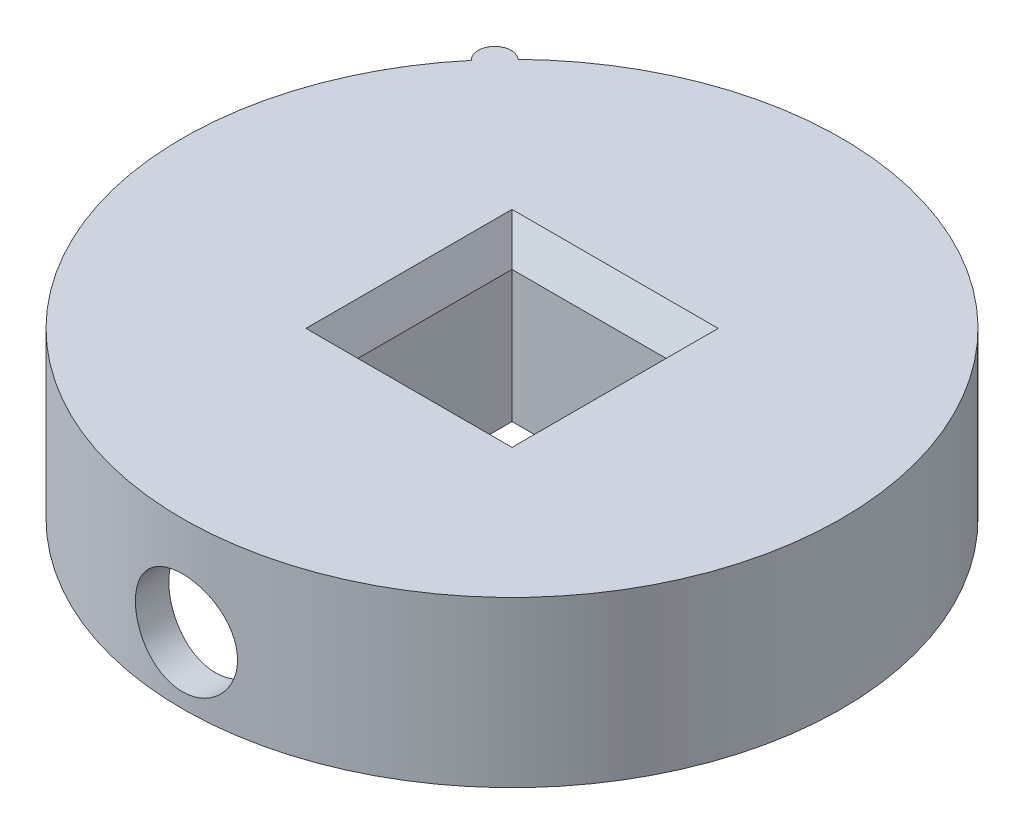
ISO-10303-21;
HEADER;
FILE_DESCRIPTION(('STEP AP214'),'2;1');
FILE_NAME('part.step','',(''),(''),'','','');
FILE_SCHEMA(('AUTOMOTIVE_DESIGN { 1 0 10303 214 1 1 1 1 }'));
ENDSEC;
DATA;
#1=APPLICATION_CONTEXT('core data for automotive mechanical design processes');
#2=APPLICATION_PROTOCOL_DEFINITION('international standard','automotive_design',2000,#1);
#3=PRODUCT_CONTEXT('',#1,'mechanical');
#4=PRODUCT('Part','Part','',(#3));
#5=PRODUCT_RELATED_PRODUCT_CATEGORY('part','',(#4));
#6=PRODUCT_DEFINITION_FORMATION('','',#4);
#7=PRODUCT_DEFINITION_CONTEXT('part definition',#1,'design');
#8=PRODUCT_DEFINITION('design','',#6,#7);
#9=PRODUCT_DEFINITION_SHAPE('','',#8);
#10=(LENGTH_UNIT() NAMED_UNIT(*) SI_UNIT(.MILLI.,.METRE.));
#11=(NAMED_UNIT(*) PLANE_ANGLE_UNIT() SI_UNIT($,.RADIAN.));
#12=(NAMED_UNIT(*) SI_UNIT($,.STERADIAN.) SOLID_ANGLE_UNIT());
#13=UNCERTAINTY_MEASURE_WITH_UNIT(LENGTH_MEASURE(1.E-05),#10,'distance_accuracy_value','');
#14=(GEOMETRIC_REPRESENTATION_CONTEXT(3) GLOBAL_UNCERTAINTY_ASSIGNED_CONTEXT((#13)) GLOBAL_UNIT_ASSIGNED_CONTEXT((#10,
#11,#12)) REPRESENTATION_CONTEXT('',''));
#15=CARTESIAN_POINT('',(0.,0.,0.));
#16=DIRECTION('',(0.,0.,1.));
#17=DIRECTION('',(1.,0.,0.));
#18=AXIS2_PLACEMENT_3D('',#15,#16,#17);
#19=CARTESIAN_POINT('',(0.,10.,0.));
#20=DIRECTION('',(0.,-1.,0.));
#21=DIRECTION('',(0.,0.,-1.));
#22=AXIS2_PLACEMENT_3D('',#19,#20,#21);
#23=CYLINDRICAL_SURFACE('',#22,20.);
#24=CARTESIAN_POINT('',(0.,10.,0.));
#25=DIRECTION('',(0.,1.,0.));
#26=DIRECTION('',(0.,0.,1.));
#27=AXIS2_PLACEMENT_3D('',#24,#25,#26);
#28=CIRCLE('',#27,20.);
#29=CARTESIAN_POINT('',(-15.3208888623795,10.,-12.8557521937308));
#30=VERTEX_POINT('',#29);
#31=CARTESIAN_POINT('',(-13.960317173332,10.,-14.3216460094491));
#32=VERTEX_POINT('',#31);
#33=EDGE_CURVE('E130',#30,#32,#28,.T.);
#34=ORIENTED_EDGE('',*,*,#33,.F.);
#35=DIRECTION('',(0.,1.,0.));
#36=VECTOR('',#35,1.);
#37=CARTESIAN_POINT('',(-15.3208888623796,-2.41380726338418,-12.8557521937307));
#38=LINE('',#37,#36);
#39=CARTESIAN_POINT('',(-15.3208888623796,0.,-12.8557521937307));
#40=VERTEX_POINT('',#39);
#41=EDGE_CURVE('E134',#40,#30,#38,.T.);
#42=ORIENTED_EDGE('',*,*,#41,.F.);
#43=CARTESIAN_POINT('',(0.,0.,0.));
#44=DIRECTION('',(0.,1.,0.));
#45=DIRECTION('',(0.,0.,1.));
#46=AXIS2_PLACEMENT_3D('',#43,#44,#45);
#47=CIRCLE('',#46,20.);
#48=CARTESIAN_POINT('',(-13.960317173332,0.,-14.3216460094491));
#49=VERTEX_POINT('',#48);
#50=EDGE_CURVE('E123',#40,#49,#47,.T.);
#51=ORIENTED_EDGE('',*,*,#50,.T.);
#52=DIRECTION('',(0.,1.,0.));
#53=VECTOR('',#52,1.);
#54=CARTESIAN_POINT('',(-13.9603171733319,-2.41380726338418,-14.3216460094492));
#55=LINE('',#54,#53);
#56=EDGE_CURVE('E140',#49,#32,#55,.T.);
#57=ORIENTED_EDGE('',*,*,#56,.T.);
#58=EDGE_LOOP('',(#34,#42,#51,#57));
#59=FACE_BOUND('',#58,.T.);
#60=CARTESIAN_POINT('',(0.,0.9,20.));
#61=CARTESIAN_POINT('',(0.173016557974578,0.900007080795432,19.9999971650391));
#62=CARTESIAN_POINT('',(0.34613178639695,0.914533455175428,19.9977314078076));
#63=CARTESIAN_POINT('',(0.687518635637837,0.972237701724927,19.9889109487694));
#64=CARTESIAN_POINT('',(0.855785454793477,1.01544302312093,19.9823521380743));
#65=CARTESIAN_POINT('',(1.18248593303596,1.1291791256332,19.9656822285072));
#66=CARTESIAN_POINT('',(1.34092709214203,1.19968875969523,19.9555738792985));
#67=CARTESIAN_POINT('',(1.64370610687182,1.36597920536802,19.9329202594809));
#68=CARTESIAN_POINT('',(1.78804581720928,1.46175668743951,19.9203753099998));
#69=CARTESIAN_POINT('',(2.05974845786461,1.67671260326108,19.8941255745019));
#70=CARTESIAN_POINT('',(2.18697707204052,1.79605986049788,19.8804128527335));
#71=CARTESIAN_POINT('',(2.4196867060257,2.05440416109371,19.85343479463));
#72=CARTESIAN_POINT('',(2.52516644076686,2.19340236474357,19.8401694847697));
#73=CARTESIAN_POINT('',(2.71191152805789,2.48801131649957,19.8155112551125));
#74=CARTESIAN_POINT('',(2.79304608511286,2.64370590555726,19.8041285915852));
#75=CARTESIAN_POINT('',(2.92796168702672,2.96671880338056,19.7846333252768));
#76=CARTESIAN_POINT('',(2.98174432506344,3.13403643448893,19.7765205320398));
#77=CARTESIAN_POINT('',(3.06001047470206,3.47412991875066,19.7645618858971));
#78=CARTESIAN_POINT('',(3.08472451807274,3.64685151766504,19.7606824776643));
#79=CARTESIAN_POINT('',(3.1048662780187,3.99403042740349,19.7575280822113));
#80=CARTESIAN_POINT('',(3.10029578872548,4.16848763124104,19.758252812916));
#81=CARTESIAN_POINT('',(3.06218643754866,4.5125521067266,19.7641941390446));
#82=CARTESIAN_POINT('',(3.02890496858939,4.68218867658666,19.7693708216034));
#83=CARTESIAN_POINT('',(2.93472161326262,5.01344040797057,19.783570384335));
#84=CARTESIAN_POINT('',(2.87381889722358,5.17505532838282,19.7925933800408));
#85=CARTESIAN_POINT('',(2.72585610559503,5.48645559505007,19.8135127113495));
#86=CARTESIAN_POINT('',(2.63868762651754,5.6361886031537,19.8254209140239));
#87=CARTESIAN_POINT('',(2.44074483457386,5.91899998169321,19.8507604280544));
#88=CARTESIAN_POINT('',(2.32996886913798,6.05207718515487,19.8641918460077));
#89=CARTESIAN_POINT('',(2.0865457846287,6.29929060689683,19.8912404778778));
#90=CARTESIAN_POINT('',(1.95367749855783,6.41320911235008,19.9048581429418));
#91=CARTESIAN_POINT('',(1.67059352836411,6.61716458384982,19.9306117241799));
#92=CARTESIAN_POINT('',(1.52037775867124,6.70720143208794,19.9427476330443));
#93=CARTESIAN_POINT('',(1.20666955981141,6.86085145308918,19.9641842572175));
#94=CARTESIAN_POINT('',(1.04316842223976,6.92444712418766,19.973483093561));
#95=CARTESIAN_POINT('',(0.707630368591965,7.02321658476251,19.9881823322231));
#96=CARTESIAN_POINT('',(0.535594070043371,7.05839242726859,19.9935830161389));
#97=CARTESIAN_POINT('',(0.18974745321463,7.09903258858386,19.999839979177));
#98=CARTESIAN_POINT('',(0.0159730895823901,7.10479609111716,20.0007420165939));
#99=CARTESIAN_POINT('',(-0.330059915144203,7.08724310983438,19.9980248327243));
#100=CARTESIAN_POINT('',(-0.5023186062509,7.06392758918426,19.9944057611877));
#101=CARTESIAN_POINT('',(-0.839519062554434,6.98912721291357,19.9830813062526));
#102=CARTESIAN_POINT('',(-1.00449408808775,6.93778880133858,19.9753971727289));
#103=CARTESIAN_POINT('',(-1.32349525981676,6.80855487063498,19.9568011840378));
#104=CARTESIAN_POINT('',(-1.4775208615223,6.73065803193059,19.9458891684944));
#105=CARTESIAN_POINT('',(-1.7715619191957,6.54982138344464,19.9219357385274));
#106=CARTESIAN_POINT('',(-1.91145985994471,6.44669262669295,19.9088785142824));
#107=CARTESIAN_POINT('',(-2.17206987835387,6.21858173575031,19.8821353568535));
#108=CARTESIAN_POINT('',(-2.29278076018428,6.09359824048571,19.8684493845514));
#109=CARTESIAN_POINT('',(-2.51268466926641,5.82399085535137,19.8418452953327));
#110=CARTESIAN_POINT('',(-2.61167667299673,5.67920210042096,19.8289350943909));
#111=CARTESIAN_POINT('',(-2.78393359428538,5.37487547615815,19.805486686096));
#112=CARTESIAN_POINT('',(-2.85719924335206,5.21533802635611,19.7949484113023));
#113=CARTESIAN_POINT('',(-2.97561529141455,4.88663129933381,19.7774949611492));
#114=CARTESIAN_POINT('',(-3.02086981632308,4.71750027657163,19.7705663828432));
#115=CARTESIAN_POINT('',(-3.08230938314147,4.37392249209178,19.7610817453396));
#116=CARTESIAN_POINT('',(-3.09849658118311,4.1994761256275,19.7585253618258));
#117=CARTESIAN_POINT('',(-3.10128813555182,3.85222422779024,19.7580872149381));
#118=CARTESIAN_POINT('',(-3.08820865954259,3.67942121854002,19.7601554912251));
#119=CARTESIAN_POINT('',(-3.03351744801726,3.33850471906413,19.7686247773595));
#120=CARTESIAN_POINT('',(-2.99190577093735,3.17039121923471,19.7750257783332));
#121=CARTESIAN_POINT('',(-2.88144589881863,2.84372354234137,19.791421373363));
#122=CARTESIAN_POINT('',(-2.81262129276619,2.68516122283937,19.801412854401));
#123=CARTESIAN_POINT('',(-2.64972096024408,2.3817828432796,19.8238671717296));
#124=CARTESIAN_POINT('',(-2.55564426248003,2.23696731226727,19.836330103077));
#125=CARTESIAN_POINT('',(-2.34376738116094,1.96358948224111,19.862483054043));
#126=CARTESIAN_POINT('',(-2.22573346513276,1.83520939110733,19.876184362017));
#127=CARTESIAN_POINT('',(-1.96978661876277,1.59996736742,19.903177261943));
#128=CARTESIAN_POINT('',(-1.8318690851942,1.49311043142968,19.9164687581527));
#129=CARTESIAN_POINT('',(-1.53910930505027,1.30338057555414,19.9412344524066));
#130=CARTESIAN_POINT('',(-1.38417199504349,1.22065289513756,19.9526974646132));
#131=CARTESIAN_POINT('',(-1.06249346622742,1.08252095182279,19.9724052696854));
#132=CARTESIAN_POINT('',(-0.895764538907991,1.02708870280286,19.9806533570105));
#133=CARTESIAN_POINT('',(-0.606929877005346,0.957540053066292,19.9911430658503));
#134=CARTESIAN_POINT('',(-0.486597179715198,0.935995962038425,19.9944471586378));
#135=CARTESIAN_POINT('',(-0.244192691603641,0.907223534809589,19.9988766112674));
#136=CARTESIAN_POINT('',(-0.122120924673141,0.899995002135659,20.000002001011));
#137=CARTESIAN_POINT('',(0.,0.9,20.));
#138=B_SPLINE_CURVE_WITH_KNOTS('',3,(#60,#61,#62,#63,#64,#65,#66,#67,#68,#69,#70,#71,#72,#73,
#74,#75,#76,#77,#78,#79,#80,#81,#82,#83,#84,#85,#86,#87,#88,#89,#90,#91,#92,#93,#94,#95,#96,#97,
#98,#99,#100,#101,#102,#103,#104,#105,#106,#107,#108,#109,#110,#111,#112,#113,#114,#115,#116,
#117,#118,#119,#120,#121,#122,#123,#124,#125,#126,#127,#128,#129,#130,#131,#132,#133,#134,#135,
#136,#137),.UNSPECIFIED.,.T.,.F.,(4,2,2,2,2,2,2,2,2,2,2,2,2,2,2,2,2,2,2,2,2,2,2,2,2,2,2,2,2,2,2,
2,2,2,2,2,2,2,4),(0.,0.518603389696483,1.03770386276341,1.55640309660684,2.07503401566504,
2.59752406878385,3.12004498524092,3.64532487300955,4.17057416109137,4.69162919625163,
5.21265230902045,5.72905244255467,6.24546808845431,6.76404496609117,7.28265815704321,
7.80681594553428,8.33097631965123,8.85548309023761,9.3799519674113,9.89907513525496,
10.4181811089692,10.9345999175123,11.4510443884596,11.9714813947096,12.4919508243877,
13.0170514007104,13.5421370450079,14.0652588749373,14.5883418995712,15.105801374666,
15.6232597899663,16.1402706366429,16.6573013724327,17.1796423654186,17.7021044795559,
18.2276494116379,18.7526543724209,19.1187071678768,19.4847549394298),.UNSPECIFIED.);
#139=CARTESIAN_POINT('',(0.,0.9,20.));
#140=VERTEX_POINT('',#139);
#141=EDGE_CURVE('E147',#140,#140,#138,.T.);
#142=ORIENTED_EDGE('',*,*,#141,.F.);
#143=EDGE_LOOP('',(#142));
#144=FACE_BOUND('',#143,.T.);
#145=ADVANCED_FACE('F34',(#59,#144),#23,.T.);
#146=CARTESIAN_POINT('',(0.,10.,0.));
#147=DIRECTION('',(0.,-1.,0.));
#148=DIRECTION('',(0.,0.,-1.));
#149=AXIS2_PLACEMENT_3D('',#146,#147,#148);
#150=CYLINDRICAL_SURFACE('',#149,18.);
#151=CARTESIAN_POINT('',(0.,0.,0.));
#152=DIRECTION('',(0.,1.,0.));
#153=DIRECTION('',(0.,0.,1.));
#154=AXIS2_PLACEMENT_3D('',#151,#152,#153);
#155=CIRCLE('',#154,18.);
#156=CARTESIAN_POINT('',(0.,0.,18.));
#157=VERTEX_POINT('',#156);
#158=EDGE_CURVE('E260',#157,#157,#155,.T.);
#159=ORIENTED_EDGE('',*,*,#158,.F.);
#160=EDGE_LOOP('',(#159));
#161=FACE_BOUND('',#160,.T.);
#162=CARTESIAN_POINT('',(0.,8.,0.));
#163=DIRECTION('',(0.,1.,0.));
#164=DIRECTION('',(0.,0.,1.));
#165=AXIS2_PLACEMENT_3D('',#162,#163,#164);
#166=CIRCLE('',#165,18.);
#167=CARTESIAN_POINT('',(0.,8.,18.));
#168=VERTEX_POINT('',#167);
#169=EDGE_CURVE('E246',#168,#168,#166,.T.);
#170=ORIENTED_EDGE('',*,*,#169,.T.);
#171=EDGE_LOOP('',(#170));
#172=FACE_BOUND('',#171,.T.);
#173=CARTESIAN_POINT('',(-3.1,4.,17.7310462184272));
#174=CARTESIAN_POINT('',(-3.09999313298625,3.82726272069094,17.7310494042664));
#175=CARTESIAN_POINT('',(-3.08551325830219,3.65443324166269,17.73359781963));
#176=CARTESIAN_POINT('',(-3.02800504284677,3.3136297172631,17.7435059787685));
#177=CARTESIAN_POINT('',(-2.98495091441744,3.14566020093493,17.7508700684992));
#178=CARTESIAN_POINT('',(-2.87164044523443,2.81955782532416,17.7695513490921));
#179=CARTESIAN_POINT('',(-2.80140750244069,2.66141664047294,17.7808651388806));
#180=CARTESIAN_POINT('',(-2.63579233362493,2.35917772393653,17.8061670210701));
#181=CARTESIAN_POINT('',(-2.54041271452993,2.21507853865303,17.8201548362166));
#182=CARTESIAN_POINT('',(-2.32614184855305,1.94348302334085,17.8493930596395));
#183=CARTESIAN_POINT('',(-2.20703766109128,1.81615581205768,17.8646541168498));
#184=CARTESIAN_POINT('',(-1.94915880252542,1.58318869594025,17.8946248323828));
#185=CARTESIAN_POINT('',(-1.8103829352717,1.47755011085444,17.9093344571066));
#186=CARTESIAN_POINT('',(-1.51600028932563,1.29032070282335,17.936657998033));
#187=CARTESIAN_POINT('',(-1.36029165213239,1.20888781717709,17.9492579257511));
#188=CARTESIAN_POINT('',(-1.03715174208675,1.07339715212286,17.9708237164532));
#189=CARTESIAN_POINT('',(-0.869721283594248,1.01933747313718,17.979789831599));
#190=CARTESIAN_POINT('',(-0.529639199316319,0.94064653169822,17.9930025721505));
#191=CARTESIAN_POINT('',(-0.35705518468448,0.91573085034474,17.9972947816215));
#192=CARTESIAN_POINT('',(-0.0101065543135215,0.89515029007298,18.0008328399529));
#193=CARTESIAN_POINT('',(0.164257931654621,0.899483294323953,18.0000790540098));
#194=CARTESIAN_POINT('',(0.507871793120614,0.9370562397458,17.9936460189792));
#195=CARTESIAN_POINT('',(0.677155759346085,0.969990051732044,17.988018933082));
#196=CARTESIAN_POINT('',(1.00775822133334,1.06334715589263,17.9725297958012));
#197=CARTESIAN_POINT('',(1.16907646161652,1.12377132911018,17.9626676086866));
#198=CARTESIAN_POINT('',(1.48007290317722,1.27069494452743,17.9397279725034));
#199=CARTESIAN_POINT('',(1.62969078748866,1.35731956202935,17.9266351452942));
#200=CARTESIAN_POINT('',(1.91238214853264,1.5540932748335,17.898687174683));
#201=CARTESIAN_POINT('',(2.04545419633083,1.66424439970646,17.8838318792866));
#202=CARTESIAN_POINT('',(2.29308650989974,1.90663949916695,17.8537823097114));
#203=CARTESIAN_POINT('',(2.40738472323858,2.03915111084635,17.838586137045));
#204=CARTESIAN_POINT('',(2.61216854846296,2.32160652946511,17.8097530244593));
#205=CARTESIAN_POINT('',(2.70265391082531,2.47155051904609,17.7961161008794));
#206=CARTESIAN_POINT('',(2.85730087370296,2.78492932747192,17.7719440497841));
#207=CARTESIAN_POINT('',(2.92142926062609,2.94838085830812,17.7614128406061));
#208=CARTESIAN_POINT('',(3.02124489556565,3.28395857625857,17.7447080955585));
#209=CARTESIAN_POINT('',(3.05693482896464,3.45608394268864,17.7385341482481));
#210=CARTESIAN_POINT('',(3.09848798719902,3.80177395904009,17.7313230529256));
#211=CARTESIAN_POINT('',(3.10472551762942,3.9752923138647,17.7302214459032));
#212=CARTESIAN_POINT('',(3.08819578605888,4.32089297696119,17.7331078649149));
#213=CARTESIAN_POINT('',(3.06542972381246,4.49297534433735,17.7370956804214));
#214=CARTESIAN_POINT('',(2.99185875873464,4.82961966631278,17.7496519386929));
#215=CARTESIAN_POINT('',(2.94124583341696,4.99422485025197,17.7581890061732));
#216=CARTESIAN_POINT('',(2.81361979825464,5.31261748550005,17.7788553503244));
#217=CARTESIAN_POINT('',(2.73660501354011,5.46640424976855,17.7909848548842));
#218=CARTESIAN_POINT('',(2.55748363807944,5.76045617285387,17.8176183967342));
#219=CARTESIAN_POINT('',(2.45513805299021,5.90057370577815,17.8321445840279));
#220=CARTESIAN_POINT('',(2.22858683964253,6.16178043077467,17.8618706165594));
#221=CARTESIAN_POINT('',(2.10437956531447,6.28286818870502,17.8770705124594));
#222=CARTESIAN_POINT('',(1.83596895921044,6.50395300395085,17.9066360445248));
#223=CARTESIAN_POINT('',(1.6915581469289,6.60369989266837,17.9209904913054));
#224=CARTESIAN_POINT('',(1.38781145578617,6.77751584823228,17.9470660891861));
#225=CARTESIAN_POINT('',(1.2284760847549,6.8515857883715,17.9587873298389));
#226=CARTESIAN_POINT('',(0.900133060857951,6.97155973486499,17.9782273472964));
#227=CARTESIAN_POINT('',(0.731173614747658,7.0175925824532,17.9859644071876));
#228=CARTESIAN_POINT('',(0.387777506000827,7.08059964069153,17.996641785183));
#229=CARTESIAN_POINT('',(0.213341327330556,7.09757641164158,17.9995825259176));
#230=CARTESIAN_POINT('',(-0.133646085689154,7.10191176659875,18.0003293291214));
#231=CARTESIAN_POINT('',(-0.306192548851938,7.08965025784471,17.9982012535989));
#232=CARTESIAN_POINT('',(-0.646729000742405,7.03668147658913,17.9891845992446));
#233=CARTESIAN_POINT('',(-0.814719019304073,6.99597439038589,17.9822960515906));
#234=CARTESIAN_POINT('',(-1.14121455109152,6.88741952012266,17.9645302874585));
#235=CARTESIAN_POINT('',(-1.29973179471327,6.81960613815113,17.9536581282528));
#236=CARTESIAN_POINT('',(-1.60319648346798,6.65880671706889,17.9291094270097));
#237=CARTESIAN_POINT('',(-1.74814321499517,6.5658193551832,17.9154327376165));
#238=CARTESIAN_POINT('',(-2.02226104621523,6.35597463562083,17.8865791500137));
#239=CARTESIAN_POINT('',(-2.1512181870935,6.23883999122012,17.8713859895924));
#240=CARTESIAN_POINT('',(-2.38777968814283,5.98460626618822,17.8413218089942));
#241=CARTESIAN_POINT('',(-2.49537903835792,5.84750251439415,17.8264508651275));
#242=CARTESIAN_POINT('',(-2.68692820643402,5.55598003634335,17.7985921888736));
#243=CARTESIAN_POINT('',(-2.77069172773889,5.40143742750927,17.7856196566342));
#244=CARTESIAN_POINT('',(-2.91093883284905,5.08031080000741,17.7632069636885));
#245=CARTESIAN_POINT('',(-2.96744928842572,4.9137388295448,17.7537633255382));
#246=CARTESIAN_POINT('',(-3.03951297941637,4.62213034763268,17.7415403224668));
#247=CARTESIAN_POINT('',(-3.06215859815304,4.49884552094047,17.7376272886697));
#248=CARTESIAN_POINT('',(-3.09240444505106,4.25038992086438,17.7323791080338));
#249=CARTESIAN_POINT('',(-3.10000497797507,4.12521918573439,17.7310439089767));
#250=CARTESIAN_POINT('',(-3.1,4.,17.7310462184272));
#251=B_SPLINE_CURVE_WITH_KNOTS('',3,(#173,#174,#175,#176,#177,#178,#179,#180,#181,#182,#183,
#184,#185,#186,#187,#188,#189,#190,#191,#192,#193,#194,#195,#196,#197,#198,#199,#200,#201,#202,
#203,#204,#205,#206,#207,#208,#209,#210,#211,#212,#213,#214,#215,#216,#217,#218,#219,#220,#221,
#222,#223,#224,#225,#226,#227,#228,#229,#230,#231,#232,#233,#234,#235,#236,#237,#238,#239,#240,
#241,#242,#243,#244,#245,#246,#247,#248,#249,#250),.UNSPECIFIED.,.T.,.F.,(4,2,2,2,2,2,2,2,2,2,2,
2,2,2,2,2,2,2,2,2,2,2,2,2,2,2,2,2,2,2,2,2,2,2,2,2,2,2,4),(0.,0.517753850761574,1.03597559993478,
1.55375220630103,2.07147515645401,2.59407326128228,3.11670315667935,3.64267180628803,
4.16860395102849,4.68935948381991,5.21007732809709,5.72528941141336,6.24051800801167,
6.75824812295139,7.27602291917712,7.80050309565845,8.32498876769148,8.85013335577677,
9.37522834969941,9.89363170722258,10.4120136213134,10.9268657713359,11.4417505883749,
11.961692000747,12.4816725787187,13.0074499206043,13.5332093786423,14.0565341726182,
14.5798128510276,15.0963294394443,15.6128426450766,16.128702386328,16.6445892388609,
17.1667678336015,17.6890687728398,18.2153463288493,18.7411039040315,19.1164370642766,
19.4917626214611),.UNSPECIFIED.);
#252=CARTESIAN_POINT('',(-3.1,4.,17.7310462184272));
#253=VERTEX_POINT('',#252);
#254=EDGE_CURVE('E144',#253,#253,#251,.T.);
#255=ORIENTED_EDGE('',*,*,#254,.T.);
#256=EDGE_LOOP('',(#255));
#257=FACE_BOUND('',#256,.T.);
#258=ADVANCED_FACE('F160',(#161,#172,#257),#150,.F.);
#259=CARTESIAN_POINT('',(0.,0.,0.));
#260=DIRECTION('',(0.,1.,0.));
#261=DIRECTION('',(0.,0.,1.));
#262=AXIS2_PLACEMENT_3D('',#259,#260,#261);
#263=PLANE('',#262);
#264=DIRECTION('',(0.,0.,-1.));
#265=VECTOR('',#264,1.);
#266=CARTESIAN_POINT('',(-7.1,0.,5.1));
#267=LINE('',#266,#265);
#268=CARTESIAN_POINT('',(-7.1,0.,7.1));
#269=VERTEX_POINT('',#268);
#270=CARTESIAN_POINT('',(-7.1,0.,-7.1));
#271=VERTEX_POINT('',#270);
#272=EDGE_CURVE('E251',#269,#271,#267,.T.);
#273=ORIENTED_EDGE('',*,*,#272,.T.);
#274=DIRECTION('',(1.,0.,0.));
#275=VECTOR('',#274,1.);
#276=CARTESIAN_POINT('',(5.1,0.,-7.1));
#277=LINE('',#276,#275);
#278=CARTESIAN_POINT('',(7.1,0.,-7.1));
#279=VERTEX_POINT('',#278);
#280=EDGE_CURVE('E247',#271,#279,#277,.T.);
#281=ORIENTED_EDGE('',*,*,#280,.T.);
#282=DIRECTION('',(0.,0.,1.));
#283=VECTOR('',#282,1.);
#284=CARTESIAN_POINT('',(7.1,0.,5.1));
#285=LINE('',#284,#283);
#286=CARTESIAN_POINT('',(7.1,0.,7.1));
#287=VERTEX_POINT('',#286);
#288=EDGE_CURVE('E250',#279,#287,#285,.T.);
#289=ORIENTED_EDGE('',*,*,#288,.T.);
#290=DIRECTION('',(-1.,0.,0.));
#291=VECTOR('',#290,1.);
#292=CARTESIAN_POINT('',(5.1,0.,7.1));
#293=LINE('',#292,#291);
#294=EDGE_CURVE('E254',#287,#269,#293,.T.);
#295=ORIENTED_EDGE('',*,*,#294,.T.);
#296=EDGE_LOOP('',(#273,#281,#289,#295));
#297=FACE_BOUND('',#296,.T.);
#298=DIRECTION('',(1.,0.,0.));
#299=VECTOR('',#298,1.);
#300=CARTESIAN_POINT('',(5.1,0.,-5.1));
#301=LINE('',#300,#299);
#302=CARTESIAN_POINT('',(-5.1,0.,-5.1));
#303=VERTEX_POINT('',#302);
#304=CARTESIAN_POINT('',(5.1,0.,-5.1));
#305=VERTEX_POINT('',#304);
#306=EDGE_CURVE('E240',#303,#305,#301,.T.);
#307=ORIENTED_EDGE('',*,*,#306,.F.);
#308=DIRECTION('',(0.,0.,-1.));
#309=VECTOR('',#308,1.);
#310=CARTESIAN_POINT('',(-5.1,0.,5.1));
#311=LINE('',#310,#309);
#312=CARTESIAN_POINT('',(-5.1,0.,5.1));
#313=VERTEX_POINT('',#312);
#314=EDGE_CURVE('E243',#313,#303,#311,.T.);
#315=ORIENTED_EDGE('',*,*,#314,.F.);
#316=DIRECTION('',(-1.,0.,0.));
#317=VECTOR('',#316,1.);
#318=CARTESIAN_POINT('',(5.1,0.,5.1));
#319=LINE('',#318,#317);
#320=CARTESIAN_POINT('',(5.1,0.,5.1));
#321=VERTEX_POINT('',#320);
#322=EDGE_CURVE('E230',#321,#313,#319,.T.);
#323=ORIENTED_EDGE('',*,*,#322,.F.);
#324=DIRECTION('',(0.,0.,1.));
#325=VECTOR('',#324,1.);
#326=CARTESIAN_POINT('',(5.1,0.,5.1));
#327=LINE('',#326,#325);
#328=EDGE_CURVE('E237',#305,#321,#327,.T.);
#329=ORIENTED_EDGE('',*,*,#328,.F.);
#330=EDGE_LOOP('',(#307,#315,#323,#329));
#331=FACE_BOUND('',#330,.T.);
#332=ADVANCED_FACE('F180',(#297,#331),#263,.F.);
#333=CARTESIAN_POINT('',(0.,10.,0.));
#334=DIRECTION('',(0.,1.,0.));
#335=DIRECTION('',(0.,0.,1.));
#336=AXIS2_PLACEMENT_3D('',#333,#334,#335);
#337=PLANE('',#336);
#338=DIRECTION('',(-1.,0.,0.));
#339=VECTOR('',#338,1.);
#340=CARTESIAN_POINT('',(-5.1,10.,6.25470053837925));
#341=LINE('',#340,#339);
#342=CARTESIAN_POINT('',(6.25470053837925,10.,6.25470053837925));
#343=VERTEX_POINT('',#342);
#344=CARTESIAN_POINT('',(-6.25470053837925,10.,6.25470053837925));
#345=VERTEX_POINT('',#344);
#346=EDGE_CURVE('E202',#343,#345,#341,.T.);
#347=ORIENTED_EDGE('',*,*,#346,.T.);
#348=DIRECTION('',(0.,0.,-1.));
#349=VECTOR('',#348,1.);
#350=CARTESIAN_POINT('',(-6.25470053837925,10.,-5.1));
#351=LINE('',#350,#349);
#352=CARTESIAN_POINT('',(-6.25470053837925,10.,-6.25470053837925));
#353=VERTEX_POINT('',#352);
#354=EDGE_CURVE('E218',#345,#353,#351,.T.);
#355=ORIENTED_EDGE('',*,*,#354,.T.);
#356=DIRECTION('',(1.,0.,0.));
#357=VECTOR('',#356,1.);
#358=CARTESIAN_POINT('',(5.1,10.,-6.25470053837925));
#359=LINE('',#358,#357);
#360=CARTESIAN_POINT('',(6.25470053837925,10.,-6.25470053837925));
#361=VERTEX_POINT('',#360);
#362=EDGE_CURVE('E224',#353,#361,#359,.T.);
#363=ORIENTED_EDGE('',*,*,#362,.T.);
#364=DIRECTION('',(0.,0.,1.));
#365=VECTOR('',#364,1.);
#366=CARTESIAN_POINT('',(6.25470053837925,10.,5.1));
#367=LINE('',#366,#365);
#368=EDGE_CURVE('E222',#361,#343,#367,.T.);
#369=ORIENTED_EDGE('',*,*,#368,.T.);
#370=EDGE_LOOP('',(#347,#355,#363,#369));
#371=FACE_BOUND('',#370,.T.);
#372=ORIENTED_EDGE('',*,*,#33,.T.);
#373=CARTESIAN_POINT('',(-14.6406030178558,10.,-13.58869910159));
#374=DIRECTION('',(0.,1.,0.));
#375=DIRECTION('',(0.,0.,-1.));
#376=AXIS2_PLACEMENT_3D('',#373,#374,#375);
#377=CIRCLE('',#376,1.);
#378=EDGE_CURVE('E141',#32,#30,#377,.T.);
#379=ORIENTED_EDGE('',*,*,#378,.T.);
#380=EDGE_LOOP('',(#372,#379));
#381=FACE_BOUND('',#380,.T.);
#382=ADVANCED_FACE('F322',(#371,#381),#337,.T.);
#383=ORIENTED_EDGE('',*,*,#158,.T.);
#384=EDGE_LOOP('',(#383));
#385=FACE_BOUND('',#384,.T.);
#386=ORIENTED_EDGE('',*,*,#50,.F.);
#387=CARTESIAN_POINT('',(-14.6406030178558,0.,-13.58869910159));
#388=DIRECTION('',(0.,1.,0.));
#389=DIRECTION('',(0.,0.,1.));
#390=AXIS2_PLACEMENT_3D('',#387,#388,#389);
#391=CIRCLE('',#390,1.);
#392=EDGE_CURVE('E127',#40,#49,#391,.F.);
#393=ORIENTED_EDGE('',*,*,#392,.T.);
#394=EDGE_LOOP('',(#386,#393));
#395=FACE_BOUND('',#394,.T.);
#396=ADVANCED_FACE('F125',(#385,#395),#263,.F.);
#397=CARTESIAN_POINT('',(-5.1,10.,5.1));
#398=DIRECTION('',(-1.,0.,0.));
#399=DIRECTION('',(0.,0.,1.));
#400=AXIS2_PLACEMENT_3D('',#397,#398,#399);
#401=PLANE('',#400);
#402=DIRECTION('',(0.,-1.,0.));
#403=VECTOR('',#402,1.);
#404=CARTESIAN_POINT('',(-5.1,10.,-5.1));
#405=LINE('',#404,#403);
#406=CARTESIAN_POINT('',(-5.1,7.99999999999999,-5.1));
#407=VERTEX_POINT('',#406);
#408=EDGE_CURVE('E227',#407,#303,#405,.T.);
#409=ORIENTED_EDGE('',*,*,#408,.F.);
#410=DIRECTION('',(0.,0.,1.));
#411=VECTOR('',#410,1.);
#412=CARTESIAN_POINT('',(-5.1,7.99999999999999,5.1));
#413=LINE('',#412,#411);
#414=CARTESIAN_POINT('',(-5.1,7.99999999999999,5.1));
#415=VERTEX_POINT('',#414);
#416=EDGE_CURVE('E216',#407,#415,#413,.T.);
#417=ORIENTED_EDGE('',*,*,#416,.T.);
#418=DIRECTION('',(0.,-1.,0.));
#419=VECTOR('',#418,1.);
#420=CARTESIAN_POINT('',(-5.1,10.,5.1));
#421=LINE('',#420,#419);
#422=EDGE_CURVE('E131',#415,#313,#421,.T.);
#423=ORIENTED_EDGE('',*,*,#422,.T.);
#424=ORIENTED_EDGE('',*,*,#314,.T.);
#425=EDGE_LOOP('',(#409,#417,#423,#424));
#426=FACE_BOUND('',#425,.T.);
#427=ADVANCED_FACE('F317',(#426),#401,.F.);
#428=CARTESIAN_POINT('',(5.1,10.,5.1));
#429=DIRECTION('',(0.,0.,1.));
#430=DIRECTION('',(1.,0.,0.));
#431=AXIS2_PLACEMENT_3D('',#428,#429,#430);
#432=PLANE('',#431);
#433=ORIENTED_EDGE('',*,*,#422,.F.);
#434=DIRECTION('',(1.,0.,0.));
#435=VECTOR('',#434,1.);
#436=CARTESIAN_POINT('',(5.1,7.99999999999999,5.1));
#437=LINE('',#436,#435);
#438=CARTESIAN_POINT('',(5.1,7.99999999999999,5.1));
#439=VERTEX_POINT('',#438);
#440=EDGE_CURVE('E58',#415,#439,#437,.T.);
#441=ORIENTED_EDGE('',*,*,#440,.T.);
#442=DIRECTION('',(0.,-1.,0.));
#443=VECTOR('',#442,1.);
#444=CARTESIAN_POINT('',(5.1,10.,5.1));
#445=LINE('',#444,#443);
#446=EDGE_CURVE('E232',#439,#321,#445,.T.);
#447=ORIENTED_EDGE('',*,*,#446,.T.);
#448=ORIENTED_EDGE('',*,*,#322,.T.);
#449=EDGE_LOOP('',(#433,#441,#447,#448));
#450=FACE_BOUND('',#449,.T.);
#451=ADVANCED_FACE('F314',(#450),#432,.F.);
#452=CARTESIAN_POINT('',(5.1,10.,5.1));
#453=DIRECTION('',(1.,0.,0.));
#454=DIRECTION('',(0.,0.,-1.));
#455=AXIS2_PLACEMENT_3D('',#452,#453,#454);
#456=PLANE('',#455);
#457=ORIENTED_EDGE('',*,*,#446,.F.);
#458=DIRECTION('',(0.,0.,-1.));
#459=VECTOR('',#458,1.);
#460=CARTESIAN_POINT('',(5.1,7.99999999999999,-5.1));
#461=LINE('',#460,#459);
#462=CARTESIAN_POINT('',(5.1,7.99999999999999,-5.1));
#463=VERTEX_POINT('',#462);
#464=EDGE_CURVE('E43',#439,#463,#461,.T.);
#465=ORIENTED_EDGE('',*,*,#464,.T.);
#466=DIRECTION('',(0.,-1.,0.));
#467=VECTOR('',#466,1.);
#468=CARTESIAN_POINT('',(5.1,10.,-5.1));
#469=LINE('',#468,#467);
#470=EDGE_CURVE('E229',#463,#305,#469,.T.);
#471=ORIENTED_EDGE('',*,*,#470,.T.);
#472=ORIENTED_EDGE('',*,*,#328,.T.);
#473=EDGE_LOOP('',(#457,#465,#471,#472));
#474=FACE_BOUND('',#473,.T.);
#475=ADVANCED_FACE('F299',(#474),#456,.F.);
#476=CARTESIAN_POINT('',(5.1,10.,-5.1));
#477=DIRECTION('',(0.,0.,-1.));
#478=DIRECTION('',(-1.,0.,0.));
#479=AXIS2_PLACEMENT_3D('',#476,#477,#478);
#480=PLANE('',#479);
#481=ORIENTED_EDGE('',*,*,#470,.F.);
#482=DIRECTION('',(-1.,0.,0.));
#483=VECTOR('',#482,1.);
#484=CARTESIAN_POINT('',(-5.1,7.99999999999999,-5.1));
#485=LINE('',#484,#483);
#486=EDGE_CURVE('E11',#463,#407,#485,.T.);
#487=ORIENTED_EDGE('',*,*,#486,.T.);
#488=ORIENTED_EDGE('',*,*,#408,.T.);
#489=ORIENTED_EDGE('',*,*,#306,.T.);
#490=EDGE_LOOP('',(#481,#487,#488,#489));
#491=FACE_BOUND('',#490,.T.);
#492=ADVANCED_FACE('F290',(#491),#480,.F.);
#493=CARTESIAN_POINT('',(0.,8.,0.));
#494=DIRECTION('',(0.,1.,0.));
#495=DIRECTION('',(0.,0.,1.));
#496=AXIS2_PLACEMENT_3D('',#493,#494,#495);
#497=PLANE('',#496);
#498=DIRECTION('',(0.,0.,-1.));
#499=VECTOR('',#498,1.);
#500=CARTESIAN_POINT('',(-7.1,8.,5.1));
#501=LINE('',#500,#499);
#502=CARTESIAN_POINT('',(-7.1,8.,7.1));
#503=VERTEX_POINT('',#502);
#504=CARTESIAN_POINT('',(-7.1,8.,-7.1));
#505=VERTEX_POINT('',#504);
#506=EDGE_CURVE('E257',#503,#505,#501,.T.);
#507=ORIENTED_EDGE('',*,*,#506,.F.);
#508=DIRECTION('',(-1.,0.,0.));
#509=VECTOR('',#508,1.);
#510=CARTESIAN_POINT('',(5.1,8.,7.1));
#511=LINE('',#510,#509);
#512=CARTESIAN_POINT('',(7.1,8.,7.1));
#513=VERTEX_POINT('',#512);
#514=EDGE_CURVE('E272',#513,#503,#511,.T.);
#515=ORIENTED_EDGE('',*,*,#514,.F.);
#516=DIRECTION('',(0.,0.,1.));
#517=VECTOR('',#516,1.);
#518=CARTESIAN_POINT('',(7.1,8.,5.1));
#519=LINE('',#518,#517);
#520=CARTESIAN_POINT('',(7.1,8.,-7.1));
#521=VERTEX_POINT('',#520);
#522=EDGE_CURVE('E275',#521,#513,#519,.T.);
#523=ORIENTED_EDGE('',*,*,#522,.F.);
#524=DIRECTION('',(1.,0.,0.));
#525=VECTOR('',#524,1.);
#526=CARTESIAN_POINT('',(5.1,8.,-7.1));
#527=LINE('',#526,#525);
#528=EDGE_CURVE('E278',#505,#521,#527,.T.);
#529=ORIENTED_EDGE('',*,*,#528,.F.);
#530=EDGE_LOOP('',(#507,#515,#523,#529));
#531=FACE_BOUND('',#530,.T.);
#532=ORIENTED_EDGE('',*,*,#169,.F.);
#533=EDGE_LOOP('',(#532));
#534=FACE_BOUND('',#533,.T.);
#535=ADVANCED_FACE('F287',(#531,#534),#497,.F.);
#536=CARTESIAN_POINT('',(-7.1,10.,5.1));
#537=DIRECTION('',(-1.,0.,0.));
#538=DIRECTION('',(0.,0.,1.));
#539=AXIS2_PLACEMENT_3D('',#536,#537,#538);
#540=PLANE('',#539);
#541=ORIENTED_EDGE('',*,*,#272,.F.);
#542=DIRECTION('',(0.,-1.,0.));
#543=VECTOR('',#542,1.);
#544=CARTESIAN_POINT('',(-7.1,10.,7.1));
#545=LINE('',#544,#543);
#546=EDGE_CURVE('E263',#503,#269,#545,.T.);
#547=ORIENTED_EDGE('',*,*,#546,.F.);
#548=ORIENTED_EDGE('',*,*,#506,.T.);
#549=DIRECTION('',(0.,-1.,0.));
#550=VECTOR('',#549,1.);
#551=CARTESIAN_POINT('',(-7.1,10.,-7.1));
#552=LINE('',#551,#550);
#553=EDGE_CURVE('E267',#505,#271,#552,.T.);
#554=ORIENTED_EDGE('',*,*,#553,.T.);
#555=EDGE_LOOP('',(#541,#547,#548,#554));
#556=FACE_BOUND('',#555,.T.);
#557=ADVANCED_FACE('F289',(#556),#540,.T.);
#558=CARTESIAN_POINT('',(5.1,10.,7.1));
#559=DIRECTION('',(0.,0.,1.));
#560=DIRECTION('',(1.,0.,0.));
#561=AXIS2_PLACEMENT_3D('',#558,#559,#560);
#562=PLANE('',#561);
#563=ORIENTED_EDGE('',*,*,#294,.F.);
#564=DIRECTION('',(0.,-1.,0.));
#565=VECTOR('',#564,1.);
#566=CARTESIAN_POINT('',(7.1,10.,7.1));
#567=LINE('',#566,#565);
#568=EDGE_CURVE('E266',#513,#287,#567,.T.);
#569=ORIENTED_EDGE('',*,*,#568,.F.);
#570=ORIENTED_EDGE('',*,*,#514,.T.);
#571=ORIENTED_EDGE('',*,*,#546,.T.);
#572=EDGE_LOOP('',(#563,#569,#570,#571));
#573=FACE_BOUND('',#572,.T.);
#574=ADVANCED_FACE('F296',(#573),#562,.T.);
#575=CARTESIAN_POINT('',(7.1,10.,5.1));
#576=DIRECTION('',(1.,0.,0.));
#577=DIRECTION('',(0.,0.,-1.));
#578=AXIS2_PLACEMENT_3D('',#575,#576,#577);
#579=PLANE('',#578);
#580=ORIENTED_EDGE('',*,*,#288,.F.);
#581=DIRECTION('',(0.,-1.,0.));
#582=VECTOR('',#581,1.);
#583=CARTESIAN_POINT('',(7.1,10.,-7.1));
#584=LINE('',#583,#582);
#585=EDGE_CURVE('E264',#521,#279,#584,.T.);
#586=ORIENTED_EDGE('',*,*,#585,.F.);
#587=ORIENTED_EDGE('',*,*,#522,.T.);
#588=ORIENTED_EDGE('',*,*,#568,.T.);
#589=EDGE_LOOP('',(#580,#586,#587,#588));
#590=FACE_BOUND('',#589,.T.);
#591=ADVANCED_FACE('F306',(#590),#579,.T.);
#592=CARTESIAN_POINT('',(5.1,10.,-7.1));
#593=DIRECTION('',(0.,0.,-1.));
#594=DIRECTION('',(-1.,0.,0.));
#595=AXIS2_PLACEMENT_3D('',#592,#593,#594);
#596=PLANE('',#595);
#597=ORIENTED_EDGE('',*,*,#280,.F.);
#598=ORIENTED_EDGE('',*,*,#553,.F.);
#599=ORIENTED_EDGE('',*,*,#528,.T.);
#600=ORIENTED_EDGE('',*,*,#585,.T.);
#601=EDGE_LOOP('',(#597,#598,#599,#600));
#602=FACE_BOUND('',#601,.T.);
#603=ADVANCED_FACE('F167',(#602),#596,.T.);
#604=CARTESIAN_POINT('',(0.,4.,20.));
#605=DIRECTION('',(0.,0.,-1.));
#606=DIRECTION('',(-1.,0.,0.));
#607=AXIS2_PLACEMENT_3D('',#604,#605,#606);
#608=CYLINDRICAL_SURFACE('',#607,3.1);
#609=ORIENTED_EDGE('',*,*,#254,.F.);
#610=EDGE_LOOP('',(#609));
#611=FACE_BOUND('',#610,.T.);
#612=ORIENTED_EDGE('',*,*,#141,.T.);
#613=EDGE_LOOP('',(#612));
#614=FACE_BOUND('',#613,.T.);
#615=ADVANCED_FACE('F163',(#611,#614),#608,.F.);
#616=CARTESIAN_POINT('',(-14.6406030178558,-2.41380726338418,-13.58869910159));
#617=DIRECTION('',(0.,1.,0.));
#618=DIRECTION('',(0.,0.,1.));
#619=AXIS2_PLACEMENT_3D('',#616,#617,#618);
#620=CYLINDRICAL_SURFACE('',#619,1.);
#621=ORIENTED_EDGE('',*,*,#392,.F.);
#622=ORIENTED_EDGE('',*,*,#41,.T.);
#623=ORIENTED_EDGE('',*,*,#378,.F.);
#624=ORIENTED_EDGE('',*,*,#56,.F.);
#625=EDGE_LOOP('',(#621,#622,#623,#624));
#626=FACE_BOUND('',#625,.T.);
#627=ADVANCED_FACE('F143',(#626),#620,.T.);
#628=CARTESIAN_POINT('',(6.25470053837925,10.,0.));
#629=DIRECTION('',(-0.866025403784439,0.499999999999999,0.));
#630=DIRECTION('',(0.,0.,-1.));
#631=AXIS2_PLACEMENT_3D('',#628,#629,#630);
#632=PLANE('',#631);
#633=DIRECTION('',(0.447213595499957,0.774596669241485,-0.447213595499957));
#634=VECTOR('',#633,1.);
#635=CARTESIAN_POINT('',(5.00376043070341,7.83330817627975,-5.00376043070341));
#636=LINE('',#635,#634);
#637=EDGE_CURVE('E204',#463,#361,#636,.T.);
#638=ORIENTED_EDGE('',*,*,#637,.F.);
#639=ORIENTED_EDGE('',*,*,#464,.F.);
#640=DIRECTION('',(0.447213595499957,0.774596669241484,0.447213595499957));
#641=VECTOR('',#640,1.);
#642=CARTESIAN_POINT('',(5.0037604307034,7.83330817627975,5.00376043070341));
#643=LINE('',#642,#641);
#644=EDGE_CURVE('E38',#343,#439,#643,.F.);
#645=ORIENTED_EDGE('',*,*,#644,.F.);
#646=ORIENTED_EDGE('',*,*,#368,.F.);
#647=EDGE_LOOP('',(#638,#639,#645,#646));
#648=FACE_BOUND('',#647,.T.);
#649=ADVANCED_FACE('F36',(#648),#632,.T.);
#650=CARTESIAN_POINT('',(0.,10.,6.25470053837925));
#651=DIRECTION('',(0.,0.499999999999999,-0.866025403784439));
#652=DIRECTION('',(1.,0.,0.));
#653=AXIS2_PLACEMENT_3D('',#650,#651,#652);
#654=PLANE('',#653);
#655=ORIENTED_EDGE('',*,*,#644,.T.);
#656=ORIENTED_EDGE('',*,*,#440,.F.);
#657=DIRECTION('',(-0.447213595499957,0.774596669241485,0.447213595499957));
#658=VECTOR('',#657,1.);
#659=CARTESIAN_POINT('',(-5.00376043070341,7.83330817627975,5.00376043070341));
#660=LINE('',#659,#658);
#661=EDGE_CURVE('E206',#345,#415,#660,.F.);
#662=ORIENTED_EDGE('',*,*,#661,.F.);
#663=ORIENTED_EDGE('',*,*,#346,.F.);
#664=EDGE_LOOP('',(#655,#656,#662,#663));
#665=FACE_BOUND('',#664,.T.);
#666=ADVANCED_FACE('F174',(#665),#654,.T.);
#667=CARTESIAN_POINT('',(0.,10.,-6.25470053837925));
#668=DIRECTION('',(0.,0.499999999999999,0.866025403784439));
#669=DIRECTION('',(-1.,0.,0.));
#670=AXIS2_PLACEMENT_3D('',#667,#668,#669);
#671=PLANE('',#670);
#672=ORIENTED_EDGE('',*,*,#637,.T.);
#673=ORIENTED_EDGE('',*,*,#362,.F.);
#674=DIRECTION('',(0.447213595499957,-0.774596669241485,0.447213595499957));
#675=VECTOR('',#674,1.);
#676=CARTESIAN_POINT('',(-5.00376043070341,7.83330817627975,-5.00376043070341));
#677=LINE('',#676,#675);
#678=EDGE_CURVE('E210',#407,#353,#677,.F.);
#679=ORIENTED_EDGE('',*,*,#678,.F.);
#680=ORIENTED_EDGE('',*,*,#486,.F.);
#681=EDGE_LOOP('',(#672,#673,#679,#680));
#682=FACE_BOUND('',#681,.T.);
#683=ADVANCED_FACE('F189',(#682),#671,.T.);
#684=CARTESIAN_POINT('',(-6.25470053837925,10.,0.));
#685=DIRECTION('',(0.866025403784439,0.499999999999999,0.));
#686=DIRECTION('',(0.,0.,1.));
#687=AXIS2_PLACEMENT_3D('',#684,#685,#686);
#688=PLANE('',#687);
#689=ORIENTED_EDGE('',*,*,#661,.T.);
#690=ORIENTED_EDGE('',*,*,#416,.F.);
#691=ORIENTED_EDGE('',*,*,#678,.T.);
#692=ORIENTED_EDGE('',*,*,#354,.F.);
#693=EDGE_LOOP('',(#689,#690,#691,#692));
#694=FACE_BOUND('',#693,.T.);
#695=ADVANCED_FACE('F186',(#694),#688,.T.);
#696=CLOSED_SHELL('',(#145,#258,#332,#382,#396,#427,#451,#475,#492,#535,#557,#574,#591,#603,
#615,#627,#649,#666,#683,#695));
#697=MANIFOLD_SOLID_BREP('B2',#696);
#698=ADVANCED_BREP_SHAPE_REPRESENTATION('',(#18,#697),#14);
#699=SHAPE_DEFINITION_REPRESENTATION(#9,#698);
ENDSEC;
END-ISO-10303-21;
